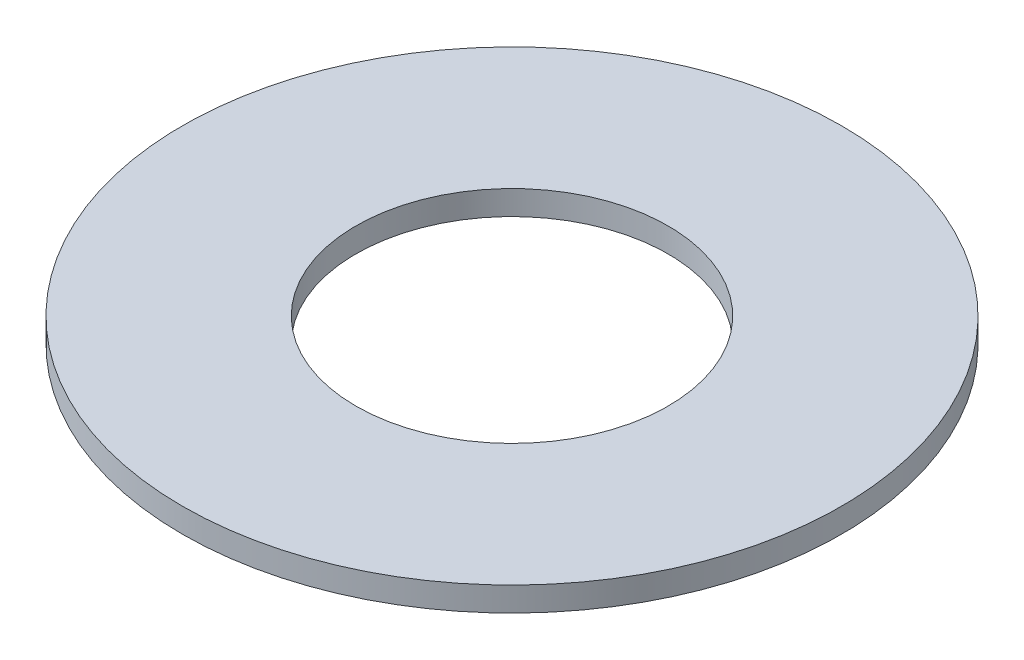
ISO-10303-21;
HEADER;
FILE_DESCRIPTION(('STEP AP214'),'2;1');
FILE_NAME('part.step','',(''),(''),'','','');
FILE_SCHEMA(('AUTOMOTIVE_DESIGN { 1 0 10303 214 1 1 1 1 }'));
ENDSEC;
DATA;
#1=APPLICATION_CONTEXT('core data for automotive mechanical design processes');
#2=APPLICATION_PROTOCOL_DEFINITION('international standard','automotive_design',2000,#1);
#3=PRODUCT_CONTEXT('',#1,'mechanical');
#4=PRODUCT('Part','Part','',(#3));
#5=PRODUCT_RELATED_PRODUCT_CATEGORY('part','',(#4));
#6=PRODUCT_DEFINITION_FORMATION('','',#4);
#7=PRODUCT_DEFINITION_CONTEXT('part definition',#1,'design');
#8=PRODUCT_DEFINITION('design','',#6,#7);
#9=PRODUCT_DEFINITION_SHAPE('','',#8);
#10=(LENGTH_UNIT() NAMED_UNIT(*) SI_UNIT(.MILLI.,.METRE.));
#11=(NAMED_UNIT(*) PLANE_ANGLE_UNIT() SI_UNIT($,.RADIAN.));
#12=(NAMED_UNIT(*) SI_UNIT($,.STERADIAN.) SOLID_ANGLE_UNIT());
#13=UNCERTAINTY_MEASURE_WITH_UNIT(LENGTH_MEASURE(1.E-05),#10,'distance_accuracy_value','');
#14=(GEOMETRIC_REPRESENTATION_CONTEXT(3) GLOBAL_UNCERTAINTY_ASSIGNED_CONTEXT((#13)) GLOBAL_UNIT_ASSIGNED_CONTEXT((#10,
#11,#12)) REPRESENTATION_CONTEXT('',''));
#15=CARTESIAN_POINT('',(0.,0.,0.));
#16=DIRECTION('',(0.,0.,1.));
#17=DIRECTION('',(1.,0.,0.));
#18=AXIS2_PLACEMENT_3D('',#15,#16,#17);
#19=CARTESIAN_POINT('',(0.,7.,0.));
#20=DIRECTION('',(0.,-1.,0.));
#21=DIRECTION('',(0.,0.,-1.));
#22=AXIS2_PLACEMENT_3D('',#19,#20,#21);
#23=CYLINDRICAL_SURFACE('',#22,95.);
#24=CARTESIAN_POINT('',(0.,7.,0.));
#25=DIRECTION('',(0.,1.,0.));
#26=DIRECTION('',(0.,0.,1.));
#27=AXIS2_PLACEMENT_3D('',#24,#25,#26);
#28=CIRCLE('',#27,95.);
#29=CARTESIAN_POINT('',(0.,7.,95.));
#30=VERTEX_POINT('',#29);
#31=EDGE_CURVE('E10',#30,#30,#28,.T.);
#32=ORIENTED_EDGE('',*,*,#31,.F.);
#33=EDGE_LOOP('',(#32));
#34=FACE_BOUND('',#33,.T.);
#35=CARTESIAN_POINT('',(0.,0.,0.));
#36=DIRECTION('',(0.,1.,0.));
#37=DIRECTION('',(0.,0.,1.));
#38=AXIS2_PLACEMENT_3D('',#35,#36,#37);
#39=CIRCLE('',#38,95.);
#40=CARTESIAN_POINT('',(0.,0.,95.));
#41=VERTEX_POINT('',#40);
#42=EDGE_CURVE('E37',#41,#41,#39,.T.);
#43=ORIENTED_EDGE('',*,*,#42,.T.);
#44=EDGE_LOOP('',(#43));
#45=FACE_BOUND('',#44,.T.);
#46=ADVANCED_FACE('F40',(#34,#45),#23,.T.);
#47=CARTESIAN_POINT('',(0.,7.,0.));
#48=DIRECTION('',(0.,1.,0.));
#49=DIRECTION('',(0.,0.,1.));
#50=AXIS2_PLACEMENT_3D('',#47,#48,#49);
#51=PLANE('',#50);
#52=CARTESIAN_POINT('',(0.,7.,0.));
#53=DIRECTION('',(0.,1.,0.));
#54=DIRECTION('',(0.,0.,1.));
#55=AXIS2_PLACEMENT_3D('',#52,#53,#54);
#56=CIRCLE('',#55,45.);
#57=CARTESIAN_POINT('',(0.,7.,45.));
#58=VERTEX_POINT('',#57);
#59=EDGE_CURVE('E50',#58,#58,#56,.T.);
#60=ORIENTED_EDGE('',*,*,#59,.F.);
#61=EDGE_LOOP('',(#60));
#62=FACE_BOUND('',#61,.T.);
#63=ORIENTED_EDGE('',*,*,#31,.T.);
#64=EDGE_LOOP('',(#63));
#65=FACE_BOUND('',#64,.T.);
#66=ADVANCED_FACE('F59',(#62,#65),#51,.T.);
#67=CARTESIAN_POINT('',(0.,0.,0.));
#68=DIRECTION('',(0.,1.,0.));
#69=DIRECTION('',(0.,0.,1.));
#70=AXIS2_PLACEMENT_3D('',#67,#68,#69);
#71=PLANE('',#70);
#72=CARTESIAN_POINT('',(0.,0.,0.));
#73=DIRECTION('',(0.,1.,0.));
#74=DIRECTION('',(0.,0.,1.));
#75=AXIS2_PLACEMENT_3D('',#72,#73,#74);
#76=CIRCLE('',#75,45.);
#77=CARTESIAN_POINT('',(0.,0.,45.));
#78=VERTEX_POINT('',#77);
#79=EDGE_CURVE('E47',#78,#78,#76,.T.);
#80=ORIENTED_EDGE('',*,*,#79,.T.);
#81=EDGE_LOOP('',(#80));
#82=FACE_BOUND('',#81,.T.);
#83=ORIENTED_EDGE('',*,*,#42,.F.);
#84=EDGE_LOOP('',(#83));
#85=FACE_BOUND('',#84,.T.);
#86=ADVANCED_FACE('F58',(#82,#85),#71,.F.);
#87=CARTESIAN_POINT('',(0.,7.,0.));
#88=DIRECTION('',(0.,-1.,0.));
#89=DIRECTION('',(0.,0.,-1.));
#90=AXIS2_PLACEMENT_3D('',#87,#88,#89);
#91=CYLINDRICAL_SURFACE('',#90,45.);
#92=ORIENTED_EDGE('',*,*,#59,.T.);
#93=EDGE_LOOP('',(#92));
#94=FACE_BOUND('',#93,.T.);
#95=ORIENTED_EDGE('',*,*,#79,.F.);
#96=EDGE_LOOP('',(#95));
#97=FACE_BOUND('',#96,.T.);
#98=ADVANCED_FACE('F54',(#94,#97),#91,.F.);
#99=CLOSED_SHELL('',(#46,#66,#86,#98));
#100=MANIFOLD_SOLID_BREP('B2',#99);
#101=ADVANCED_BREP_SHAPE_REPRESENTATION('',(#18,#100),#14);
#102=SHAPE_DEFINITION_REPRESENTATION(#9,#101);
ENDSEC;
END-ISO-10303-21;
